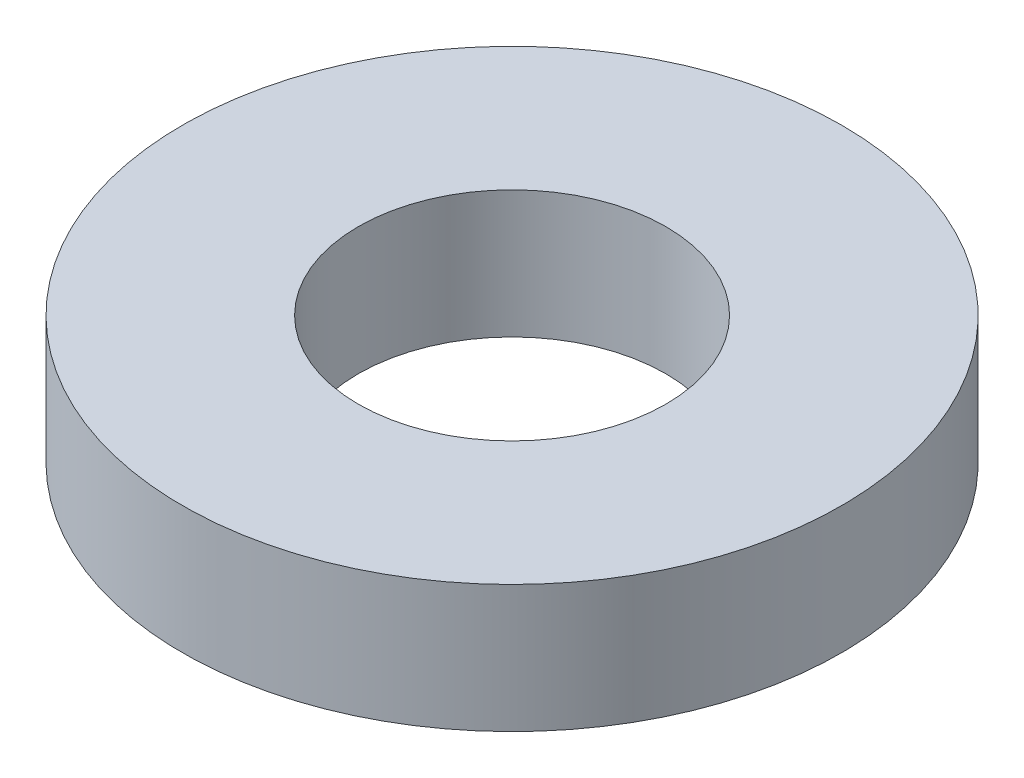
ISO-10303-21;
HEADER;
FILE_DESCRIPTION(('STEP AP214'),'2;1');
FILE_NAME('part.step','',(''),(''),'','','');
FILE_SCHEMA(('AUTOMOTIVE_DESIGN { 1 0 10303 214 1 1 1 1 }'));
ENDSEC;
DATA;
#1=APPLICATION_CONTEXT('core data for automotive mechanical design processes');
#2=APPLICATION_PROTOCOL_DEFINITION('international standard','automotive_design',2000,#1);
#3=PRODUCT_CONTEXT('',#1,'mechanical');
#4=PRODUCT('Part','Part','',(#3));
#5=PRODUCT_RELATED_PRODUCT_CATEGORY('part','',(#4));
#6=PRODUCT_DEFINITION_FORMATION('','',#4);
#7=PRODUCT_DEFINITION_CONTEXT('part definition',#1,'design');
#8=PRODUCT_DEFINITION('design','',#6,#7);
#9=PRODUCT_DEFINITION_SHAPE('','',#8);
#10=(LENGTH_UNIT() NAMED_UNIT(*) SI_UNIT(.MILLI.,.METRE.));
#11=(NAMED_UNIT(*) PLANE_ANGLE_UNIT() SI_UNIT($,.RADIAN.));
#12=(NAMED_UNIT(*) SI_UNIT($,.STERADIAN.) SOLID_ANGLE_UNIT());
#13=UNCERTAINTY_MEASURE_WITH_UNIT(LENGTH_MEASURE(1.E-05),#10,'distance_accuracy_value','');
#14=(GEOMETRIC_REPRESENTATION_CONTEXT(3) GLOBAL_UNCERTAINTY_ASSIGNED_CONTEXT((#13)) GLOBAL_UNIT_ASSIGNED_CONTEXT((#10,
#11,#12)) REPRESENTATION_CONTEXT('',''));
#15=CARTESIAN_POINT('',(0.,0.,0.));
#16=DIRECTION('',(0.,0.,1.));
#17=DIRECTION('',(1.,0.,0.));
#18=AXIS2_PLACEMENT_3D('',#15,#16,#17);
#19=CARTESIAN_POINT('',(0.,29.,0.));
#20=DIRECTION('',(0.,-1.,0.));
#21=DIRECTION('',(0.,0.,-1.));
#22=AXIS2_PLACEMENT_3D('',#19,#20,#21);
#23=CYLINDRICAL_SURFACE('',#22,75.);
#24=CARTESIAN_POINT('',(0.,29.,0.));
#25=DIRECTION('',(0.,1.,0.));
#26=DIRECTION('',(0.,0.,1.));
#27=AXIS2_PLACEMENT_3D('',#24,#25,#26);
#28=CIRCLE('',#27,75.);
#29=CARTESIAN_POINT('',(0.,29.,-75.));
#30=VERTEX_POINT('',#29);
#31=EDGE_CURVE('E10',#30,#30,#28,.T.);
#32=CARTESIAN_POINT('',(0.,0.,0.));
#33=DIRECTION('',(0.,1.,0.));
#34=DIRECTION('',(0.,0.,1.));
#35=AXIS2_PLACEMENT_3D('',#32,#33,#34);
#36=CIRCLE('',#35,75.);
#37=CARTESIAN_POINT('',(0.,0.,-75.));
#38=VERTEX_POINT('',#37);
#39=EDGE_CURVE('E37',#38,#38,#36,.T.);
#40=CARTESIAN_POINT('',(0.,29.,-75.));
#41=CARTESIAN_POINT('',(0.,28.6979166666667,-75.));
#42=CARTESIAN_POINT('',(0.,28.3958333333333,-75.));
#43=CARTESIAN_POINT('',(0.,27.7916666666667,-75.));
#44=CARTESIAN_POINT('',(0.,27.4895833333333,-75.));
#45=CARTESIAN_POINT('',(0.,26.8854166666667,-75.));
#46=CARTESIAN_POINT('',(0.,26.5833333333333,-75.));
#47=CARTESIAN_POINT('',(0.,25.9791666666667,-75.));
#48=CARTESIAN_POINT('',(0.,25.6770833333333,-75.));
#49=CARTESIAN_POINT('',(0.,25.0729166666667,-75.));
#50=CARTESIAN_POINT('',(0.,24.7708333333333,-75.));
#51=CARTESIAN_POINT('',(0.,24.1666666666667,-75.));
#52=CARTESIAN_POINT('',(0.,23.8645833333333,-75.));
#53=CARTESIAN_POINT('',(0.,23.2604166666667,-75.));
#54=CARTESIAN_POINT('',(0.,22.9583333333333,-75.));
#55=CARTESIAN_POINT('',(0.,22.3541666666667,-75.));
#56=CARTESIAN_POINT('',(0.,22.0520833333333,-75.));
#57=CARTESIAN_POINT('',(0.,21.4479166666667,-75.));
#58=CARTESIAN_POINT('',(0.,21.1458333333333,-75.));
#59=CARTESIAN_POINT('',(0.,20.5416666666667,-75.));
#60=CARTESIAN_POINT('',(0.,20.2395833333333,-75.));
#61=CARTESIAN_POINT('',(0.,19.6354166666667,-75.));
#62=CARTESIAN_POINT('',(0.,19.3333333333333,-75.));
#63=CARTESIAN_POINT('',(0.,18.7291666666667,-75.));
#64=CARTESIAN_POINT('',(0.,18.4270833333333,-75.));
#65=CARTESIAN_POINT('',(0.,17.8229166666667,-75.));
#66=CARTESIAN_POINT('',(0.,17.5208333333333,-75.));
#67=CARTESIAN_POINT('',(0.,16.9166666666667,-75.));
#68=CARTESIAN_POINT('',(0.,16.6145833333333,-75.));
#69=CARTESIAN_POINT('',(0.,16.0104166666667,-75.));
#70=CARTESIAN_POINT('',(0.,15.7083333333333,-75.));
#71=CARTESIAN_POINT('',(0.,15.1041666666667,-75.));
#72=CARTESIAN_POINT('',(0.,14.8020833333333,-75.));
#73=CARTESIAN_POINT('',(0.,14.1979166666667,-75.));
#74=CARTESIAN_POINT('',(0.,13.8958333333333,-75.));
#75=CARTESIAN_POINT('',(0.,13.2916666666667,-75.));
#76=CARTESIAN_POINT('',(0.,12.9895833333333,-75.));
#77=CARTESIAN_POINT('',(0.,12.3854166666667,-75.));
#78=CARTESIAN_POINT('',(0.,12.0833333333333,-75.));
#79=CARTESIAN_POINT('',(0.,11.4791666666667,-75.));
#80=CARTESIAN_POINT('',(0.,11.1770833333333,-75.));
#81=CARTESIAN_POINT('',(0.,10.5729166666667,-75.));
#82=CARTESIAN_POINT('',(0.,10.2708333333333,-75.));
#83=CARTESIAN_POINT('',(0.,9.66666666666667,-75.));
#84=CARTESIAN_POINT('',(0.,9.36458333333333,-75.));
#85=CARTESIAN_POINT('',(0.,8.76041666666667,-75.));
#86=CARTESIAN_POINT('',(0.,8.45833333333333,-75.));
#87=CARTESIAN_POINT('',(0.,7.85416666666667,-75.));
#88=CARTESIAN_POINT('',(0.,7.55208333333333,-75.));
#89=CARTESIAN_POINT('',(0.,6.94791666666667,-75.));
#90=CARTESIAN_POINT('',(0.,6.64583333333333,-75.));
#91=CARTESIAN_POINT('',(0.,6.04166666666667,-75.));
#92=CARTESIAN_POINT('',(0.,5.73958333333333,-75.));
#93=CARTESIAN_POINT('',(0.,5.13541666666667,-75.));
#94=CARTESIAN_POINT('',(0.,4.83333333333333,-75.));
#95=CARTESIAN_POINT('',(0.,4.22916666666667,-75.));
#96=CARTESIAN_POINT('',(0.,3.92708333333333,-75.));
#97=CARTESIAN_POINT('',(0.,3.32291666666667,-75.));
#98=CARTESIAN_POINT('',(0.,3.02083333333333,-75.));
#99=CARTESIAN_POINT('',(0.,2.41666666666667,-75.));
#100=CARTESIAN_POINT('',(0.,2.11458333333333,-75.));
#101=CARTESIAN_POINT('',(0.,1.51041666666667,-75.));
#102=CARTESIAN_POINT('',(0.,1.20833333333333,-75.));
#103=CARTESIAN_POINT('',(0.,0.604166666666667,-75.));
#104=CARTESIAN_POINT('',(0.,0.302083333333333,-75.));
#105=CARTESIAN_POINT('',(0.,0.,-75.));
#106=B_SPLINE_CURVE_WITH_KNOTS('',3,(#40,#41,#42,#43,#44,#45,#46,#47,#48,#49,#50,#51,#52,#53,
#54,#55,#56,#57,#58,#59,#60,#61,#62,#63,#64,#65,#66,#67,#68,#69,#70,#71,#72,#73,#74,#75,#76,#77,
#78,#79,#80,#81,#82,#83,#84,#85,#86,#87,#88,#89,#90,#91,#92,#93,#94,#95,#96,#97,#98,#99,#100,
#101,#102,#103,#104,#105),.UNSPECIFIED.,.F.,.F.,(4,2,2,2,2,2,2,2,2,2,2,2,2,2,2,2,2,2,2,2,2,2,2,
2,2,2,2,2,2,2,2,2,4),(0.,0.906250000000001,1.8125,2.71875,3.625,4.53125,5.4375,6.34375,7.25,
8.15625,9.0625,9.96875,10.875,11.78125,12.6875,13.59375,14.5,15.40625,16.3125,17.21875,18.125,
19.03125,19.9375,20.84375,21.75,22.65625,23.5625,24.46875,25.375,26.28125,27.1875,28.09375,29.),.UNSPECIFIED.);
#107=EDGE_CURVE('BSEAM40',#30,#38,#106,.T.);
#108=ORIENTED_EDGE('',*,*,#31,.F.);
#109=ORIENTED_EDGE('',*,*,#39,.T.);
#110=ORIENTED_EDGE('',*,*,#107,.T.);
#111=ORIENTED_EDGE('',*,*,#107,.F.);
#112=EDGE_LOOP('',(#108,#110,#109,#111));
#113=FACE_BOUND('',#112,.T.);
#114=ADVANCED_FACE('F40',(#113),#23,.T.);
#115=CARTESIAN_POINT('',(0.,29.,0.));
#116=DIRECTION('',(0.,1.,0.));
#117=DIRECTION('',(0.,0.,1.));
#118=AXIS2_PLACEMENT_3D('',#115,#116,#117);
#119=PLANE('',#118);
#120=CARTESIAN_POINT('',(0.,29.,0.));
#121=DIRECTION('',(0.,1.,0.));
#122=DIRECTION('',(0.,0.,1.));
#123=AXIS2_PLACEMENT_3D('',#120,#121,#122);
#124=CIRCLE('',#123,35.);
#125=CARTESIAN_POINT('',(0.,29.,-35.));
#126=VERTEX_POINT('',#125);
#127=EDGE_CURVE('E50',#126,#126,#124,.T.);
#128=ORIENTED_EDGE('',*,*,#127,.F.);
#129=EDGE_LOOP('',(#128));
#130=FACE_BOUND('',#129,.T.);
#131=ORIENTED_EDGE('',*,*,#31,.T.);
#132=EDGE_LOOP('',(#131));
#133=FACE_BOUND('',#132,.T.);
#134=ADVANCED_FACE('F59',(#130,#133),#119,.T.);
#135=CARTESIAN_POINT('',(0.,0.,0.));
#136=DIRECTION('',(0.,1.,0.));
#137=DIRECTION('',(0.,0.,1.));
#138=AXIS2_PLACEMENT_3D('',#135,#136,#137);
#139=PLANE('',#138);
#140=CARTESIAN_POINT('',(0.,0.,0.));
#141=DIRECTION('',(0.,1.,0.));
#142=DIRECTION('',(0.,0.,1.));
#143=AXIS2_PLACEMENT_3D('',#140,#141,#142);
#144=CIRCLE('',#143,35.);
#145=CARTESIAN_POINT('',(0.,0.,-35.));
#146=VERTEX_POINT('',#145);
#147=EDGE_CURVE('E47',#146,#146,#144,.T.);
#148=ORIENTED_EDGE('',*,*,#147,.T.);
#149=EDGE_LOOP('',(#148));
#150=FACE_BOUND('',#149,.T.);
#151=ORIENTED_EDGE('',*,*,#39,.F.);
#152=EDGE_LOOP('',(#151));
#153=FACE_BOUND('',#152,.T.);
#154=ADVANCED_FACE('F58',(#150,#153),#139,.F.);
#155=CARTESIAN_POINT('',(0.,29.,0.));
#156=DIRECTION('',(0.,-1.,0.));
#157=DIRECTION('',(0.,0.,-1.));
#158=AXIS2_PLACEMENT_3D('',#155,#156,#157);
#159=CYLINDRICAL_SURFACE('',#158,35.);
#160=CARTESIAN_POINT('',(0.,29.,-35.));
#161=CARTESIAN_POINT('',(0.,28.6979166666667,-35.));
#162=CARTESIAN_POINT('',(0.,28.3958333333333,-35.));
#163=CARTESIAN_POINT('',(0.,27.7916666666667,-35.));
#164=CARTESIAN_POINT('',(0.,27.4895833333333,-35.));
#165=CARTESIAN_POINT('',(0.,26.8854166666667,-35.));
#166=CARTESIAN_POINT('',(0.,26.5833333333333,-35.));
#167=CARTESIAN_POINT('',(0.,25.9791666666667,-35.));
#168=CARTESIAN_POINT('',(0.,25.6770833333333,-35.));
#169=CARTESIAN_POINT('',(0.,25.0729166666667,-35.));
#170=CARTESIAN_POINT('',(0.,24.7708333333333,-35.));
#171=CARTESIAN_POINT('',(0.,24.1666666666667,-35.));
#172=CARTESIAN_POINT('',(0.,23.8645833333333,-35.));
#173=CARTESIAN_POINT('',(0.,23.2604166666667,-35.));
#174=CARTESIAN_POINT('',(0.,22.9583333333333,-35.));
#175=CARTESIAN_POINT('',(0.,22.3541666666667,-35.));
#176=CARTESIAN_POINT('',(0.,22.0520833333333,-35.));
#177=CARTESIAN_POINT('',(0.,21.4479166666667,-35.));
#178=CARTESIAN_POINT('',(0.,21.1458333333333,-35.));
#179=CARTESIAN_POINT('',(0.,20.5416666666667,-35.));
#180=CARTESIAN_POINT('',(0.,20.2395833333333,-35.));
#181=CARTESIAN_POINT('',(0.,19.6354166666667,-35.));
#182=CARTESIAN_POINT('',(0.,19.3333333333333,-35.));
#183=CARTESIAN_POINT('',(0.,18.7291666666667,-35.));
#184=CARTESIAN_POINT('',(0.,18.4270833333333,-35.));
#185=CARTESIAN_POINT('',(0.,17.8229166666667,-35.));
#186=CARTESIAN_POINT('',(0.,17.5208333333333,-35.));
#187=CARTESIAN_POINT('',(0.,16.9166666666667,-35.));
#188=CARTESIAN_POINT('',(0.,16.6145833333333,-35.));
#189=CARTESIAN_POINT('',(0.,16.0104166666667,-35.));
#190=CARTESIAN_POINT('',(0.,15.7083333333333,-35.));
#191=CARTESIAN_POINT('',(0.,15.1041666666667,-35.));
#192=CARTESIAN_POINT('',(0.,14.8020833333333,-35.));
#193=CARTESIAN_POINT('',(0.,14.1979166666667,-35.));
#194=CARTESIAN_POINT('',(0.,13.8958333333333,-35.));
#195=CARTESIAN_POINT('',(0.,13.2916666666667,-35.));
#196=CARTESIAN_POINT('',(0.,12.9895833333333,-35.));
#197=CARTESIAN_POINT('',(0.,12.3854166666667,-35.));
#198=CARTESIAN_POINT('',(0.,12.0833333333333,-35.));
#199=CARTESIAN_POINT('',(0.,11.4791666666667,-35.));
#200=CARTESIAN_POINT('',(0.,11.1770833333333,-35.));
#201=CARTESIAN_POINT('',(0.,10.5729166666667,-35.));
#202=CARTESIAN_POINT('',(0.,10.2708333333333,-35.));
#203=CARTESIAN_POINT('',(0.,9.66666666666667,-35.));
#204=CARTESIAN_POINT('',(0.,9.36458333333333,-35.));
#205=CARTESIAN_POINT('',(0.,8.76041666666667,-35.));
#206=CARTESIAN_POINT('',(0.,8.45833333333333,-35.));
#207=CARTESIAN_POINT('',(0.,7.85416666666667,-35.));
#208=CARTESIAN_POINT('',(0.,7.55208333333333,-35.));
#209=CARTESIAN_POINT('',(0.,6.94791666666667,-35.));
#210=CARTESIAN_POINT('',(0.,6.64583333333333,-35.));
#211=CARTESIAN_POINT('',(0.,6.04166666666667,-35.));
#212=CARTESIAN_POINT('',(0.,5.73958333333333,-35.));
#213=CARTESIAN_POINT('',(0.,5.13541666666667,-35.));
#214=CARTESIAN_POINT('',(0.,4.83333333333333,-35.));
#215=CARTESIAN_POINT('',(0.,4.22916666666667,-35.));
#216=CARTESIAN_POINT('',(0.,3.92708333333333,-35.));
#217=CARTESIAN_POINT('',(0.,3.32291666666667,-35.));
#218=CARTESIAN_POINT('',(0.,3.02083333333333,-35.));
#219=CARTESIAN_POINT('',(0.,2.41666666666667,-35.));
#220=CARTESIAN_POINT('',(0.,2.11458333333333,-35.));
#221=CARTESIAN_POINT('',(0.,1.51041666666667,-35.));
#222=CARTESIAN_POINT('',(0.,1.20833333333333,-35.));
#223=CARTESIAN_POINT('',(0.,0.604166666666667,-35.));
#224=CARTESIAN_POINT('',(0.,0.302083333333333,-35.));
#225=CARTESIAN_POINT('',(0.,0.,-35.));
#226=B_SPLINE_CURVE_WITH_KNOTS('',3,(#160,#161,#162,#163,#164,#165,#166,#167,#168,#169,#170,
#171,#172,#173,#174,#175,#176,#177,#178,#179,#180,#181,#182,#183,#184,#185,#186,#187,#188,#189,
#190,#191,#192,#193,#194,#195,#196,#197,#198,#199,#200,#201,#202,#203,#204,#205,#206,#207,#208,
#209,#210,#211,#212,#213,#214,#215,#216,#217,#218,#219,#220,#221,#222,#223,#224,#225),
.UNSPECIFIED.,.F.,.F.,(4,2,2,2,2,2,2,2,2,2,2,2,2,2,2,2,2,2,2,2,2,2,2,2,2,2,2,2,2,2,2,2,4),(0.,
0.906250000000001,1.8125,2.71875,3.625,4.53125,5.4375,6.34375,7.25,8.15625,9.0625,9.96875,
10.875,11.78125,12.6875,13.59375,14.5,15.40625,16.3125,17.21875,18.125,19.03125,19.9375,
20.84375,21.75,22.65625,23.5625,24.46875,25.375,26.28125,27.1875,28.09375,29.),.UNSPECIFIED.);
#227=EDGE_CURVE('BSEAM54',#126,#146,#226,.T.);
#228=ORIENTED_EDGE('',*,*,#127,.T.);
#229=ORIENTED_EDGE('',*,*,#147,.F.);
#230=ORIENTED_EDGE('',*,*,#227,.T.);
#231=ORIENTED_EDGE('',*,*,#227,.F.);
#232=EDGE_LOOP('',(#228,#230,#229,#231));
#233=FACE_BOUND('',#232,.T.);
#234=ADVANCED_FACE('F54',(#233),#159,.F.);
#235=CLOSED_SHELL('',(#114,#134,#154,#234));
#236=MANIFOLD_SOLID_BREP('B2',#235);
#237=ADVANCED_BREP_SHAPE_REPRESENTATION('',(#18,#236),#14);
#238=SHAPE_DEFINITION_REPRESENTATION(#9,#237);
ENDSEC;
END-ISO-10303-21;
